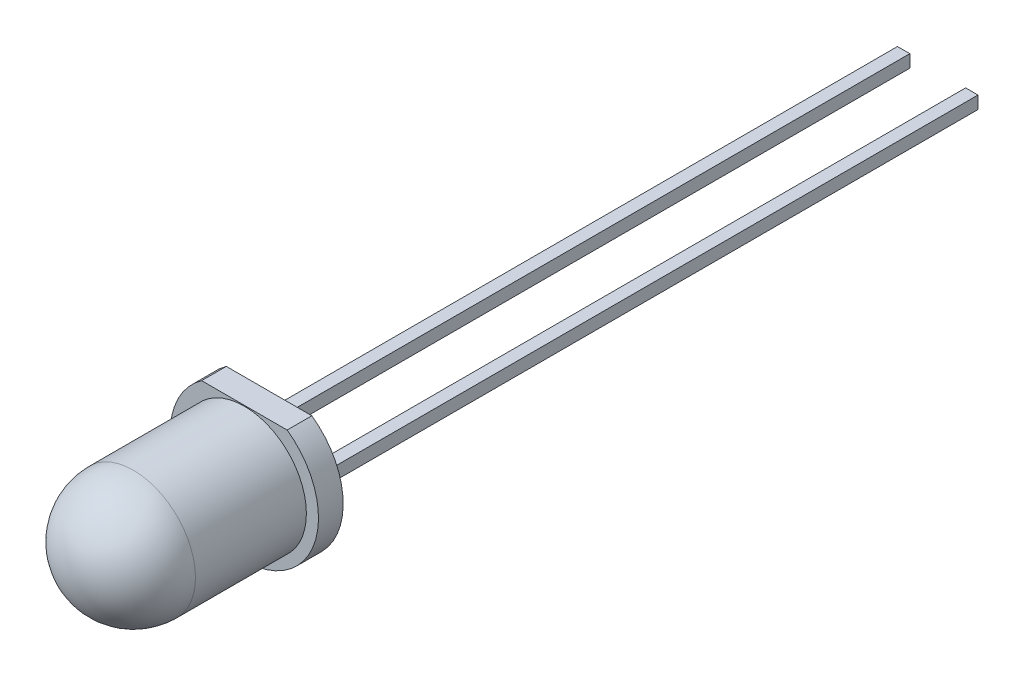
ISO-10303-21;
HEADER;
FILE_DESCRIPTION(('STEP AP214'),'2;1');
FILE_NAME('part.step','',(''),(''),'','','');
FILE_SCHEMA(('AUTOMOTIVE_DESIGN { 1 0 10303 214 1 1 1 1 }'));
ENDSEC;
DATA;
#1=APPLICATION_CONTEXT('core data for automotive mechanical design processes');
#2=APPLICATION_PROTOCOL_DEFINITION('international standard','automotive_design',2000,#1);
#3=PRODUCT_CONTEXT('',#1,'mechanical');
#4=PRODUCT('Part','Part','',(#3));
#5=PRODUCT_RELATED_PRODUCT_CATEGORY('part','',(#4));
#6=PRODUCT_DEFINITION_FORMATION('','',#4);
#7=PRODUCT_DEFINITION_CONTEXT('part definition',#1,'design');
#8=PRODUCT_DEFINITION('design','',#6,#7);
#9=PRODUCT_DEFINITION_SHAPE('','',#8);
#10=(LENGTH_UNIT() NAMED_UNIT(*) SI_UNIT(.MILLI.,.METRE.));
#11=(NAMED_UNIT(*) PLANE_ANGLE_UNIT() SI_UNIT($,.RADIAN.));
#12=(NAMED_UNIT(*) SI_UNIT($,.STERADIAN.) SOLID_ANGLE_UNIT());
#13=UNCERTAINTY_MEASURE_WITH_UNIT(LENGTH_MEASURE(1.E-05),#10,'distance_accuracy_value','');
#14=(GEOMETRIC_REPRESENTATION_CONTEXT(3) GLOBAL_UNCERTAINTY_ASSIGNED_CONTEXT((#13)) GLOBAL_UNIT_ASSIGNED_CONTEXT((#10,
#11,#12)) REPRESENTATION_CONTEXT('',''));
#15=CARTESIAN_POINT('',(0.,0.,0.));
#16=DIRECTION('',(0.,0.,1.));
#17=DIRECTION('',(1.,0.,0.));
#18=AXIS2_PLACEMENT_3D('',#15,#16,#17);
#19=CARTESIAN_POINT('',(0.,0.,0.));
#20=DIRECTION('',(0.,0.,1.));
#21=DIRECTION('',(1.,0.,0.));
#22=AXIS2_PLACEMENT_3D('',#19,#20,#21);
#23=PLANE('',#22);
#24=DIRECTION('',(0.,1.,0.));
#25=VECTOR('',#24,1.);
#26=CARTESIAN_POINT('',(-0.25,1.05,0.));
#27=LINE('',#26,#25);
#28=CARTESIAN_POINT('',(-0.25,1.05,0.));
#29=VERTEX_POINT('',#28);
#30=CARTESIAN_POINT('',(-0.25,1.56,0.));
#31=VERTEX_POINT('',#30);
#32=EDGE_CURVE('E152',#29,#31,#27,.T.);
#33=ORIENTED_EDGE('',*,*,#32,.F.);
#34=DIRECTION('',(-1.,0.,0.));
#35=VECTOR('',#34,1.);
#36=CARTESIAN_POINT('',(0.25,1.05,0.));
#37=LINE('',#36,#35);
#38=CARTESIAN_POINT('',(0.25,1.05,0.));
#39=VERTEX_POINT('',#38);
#40=EDGE_CURVE('E227',#39,#29,#37,.T.);
#41=ORIENTED_EDGE('',*,*,#40,.F.);
#42=DIRECTION('',(0.,-1.,0.));
#43=VECTOR('',#42,1.);
#44=CARTESIAN_POINT('',(0.25,1.05,0.));
#45=LINE('',#44,#43);
#46=CARTESIAN_POINT('',(0.25,1.56,0.));
#47=VERTEX_POINT('',#46);
#48=EDGE_CURVE('E317',#47,#39,#45,.T.);
#49=ORIENTED_EDGE('',*,*,#48,.F.);
#50=DIRECTION('',(1.,0.,0.));
#51=VECTOR('',#50,1.);
#52=CARTESIAN_POINT('',(0.25,1.56,0.));
#53=LINE('',#52,#51);
#54=EDGE_CURVE('E313',#31,#47,#53,.T.);
#55=ORIENTED_EDGE('',*,*,#54,.F.);
#56=EDGE_LOOP('',(#33,#41,#49,#55));
#57=FACE_BOUND('',#56,.T.);
#58=CARTESIAN_POINT('',(0.,0.,0.));
#59=DIRECTION('',(0.,0.,1.));
#60=DIRECTION('',(1.,0.,0.));
#61=AXIS2_PLACEMENT_3D('',#58,#59,#60);
#62=CIRCLE('',#61,3.);
#63=CARTESIAN_POINT('',(-1.73132896931808,2.45,0.));
#64=VERTEX_POINT('',#63);
#65=CARTESIAN_POINT('',(1.73132896931808,2.45,0.));
#66=VERTEX_POINT('',#65);
#67=EDGE_CURVE('E259',#64,#66,#62,.T.);
#68=ORIENTED_EDGE('',*,*,#67,.F.);
#69=DIRECTION('',(-1.,0.,0.));
#70=VECTOR('',#69,1.);
#71=CARTESIAN_POINT('',(-1.73132896931808,2.45,0.));
#72=LINE('',#71,#70);
#73=EDGE_CURVE('E266',#66,#64,#72,.T.);
#74=ORIENTED_EDGE('',*,*,#73,.F.);
#75=EDGE_LOOP('',(#68,#74));
#76=FACE_BOUND('',#75,.T.);
#77=DIRECTION('',(0.,1.,0.));
#78=VECTOR('',#77,1.);
#79=CARTESIAN_POINT('',(-0.25,-1.78,0.));
#80=LINE('',#79,#78);
#81=CARTESIAN_POINT('',(-0.25,-1.78,0.));
#82=VERTEX_POINT('',#81);
#83=CARTESIAN_POINT('',(-0.25,-1.27,0.));
#84=VERTEX_POINT('',#83);
#85=EDGE_CURVE('E149',#82,#84,#80,.T.);
#86=ORIENTED_EDGE('',*,*,#85,.F.);
#87=DIRECTION('',(-1.,0.,0.));
#88=VECTOR('',#87,1.);
#89=CARTESIAN_POINT('',(0.25,-1.78,0.));
#90=LINE('',#89,#88);
#91=CARTESIAN_POINT('',(0.25,-1.78,0.));
#92=VERTEX_POINT('',#91);
#93=EDGE_CURVE('E204',#92,#82,#90,.T.);
#94=ORIENTED_EDGE('',*,*,#93,.F.);
#95=DIRECTION('',(0.,-1.,0.));
#96=VECTOR('',#95,1.);
#97=CARTESIAN_POINT('',(0.25,-1.78,0.));
#98=LINE('',#97,#96);
#99=CARTESIAN_POINT('',(0.25,-1.27,0.));
#100=VERTEX_POINT('',#99);
#101=EDGE_CURVE('E73',#100,#92,#98,.T.);
#102=ORIENTED_EDGE('',*,*,#101,.F.);
#103=DIRECTION('',(1.,0.,0.));
#104=VECTOR('',#103,1.);
#105=CARTESIAN_POINT('',(0.25,-1.27,0.));
#106=LINE('',#105,#104);
#107=EDGE_CURVE('E66',#84,#100,#106,.T.);
#108=ORIENTED_EDGE('',*,*,#107,.F.);
#109=EDGE_LOOP('',(#86,#94,#102,#108));
#110=FACE_BOUND('',#109,.T.);
#111=ADVANCED_FACE('F45',(#57,#76,#110),#23,.F.);
#112=CARTESIAN_POINT('',(0.,0.,1.));
#113=DIRECTION('',(0.,0.,-1.));
#114=DIRECTION('',(-1.,0.,0.));
#115=AXIS2_PLACEMENT_3D('',#112,#113,#114);
#116=CYLINDRICAL_SURFACE('',#115,3.);
#117=ORIENTED_EDGE('',*,*,#67,.T.);
#118=DIRECTION('',(0.,0.,-1.));
#119=VECTOR('',#118,1.);
#120=CARTESIAN_POINT('',(1.73132896931808,2.45,1.));
#121=LINE('',#120,#119);
#122=CARTESIAN_POINT('',(1.73132896931808,2.45,1.));
#123=VERTEX_POINT('',#122);
#124=EDGE_CURVE('E278',#123,#66,#121,.T.);
#125=ORIENTED_EDGE('',*,*,#124,.F.);
#126=CARTESIAN_POINT('',(0.,0.,1.));
#127=DIRECTION('',(0.,0.,1.));
#128=DIRECTION('',(1.,0.,0.));
#129=AXIS2_PLACEMENT_3D('',#126,#127,#128);
#130=CIRCLE('',#129,3.);
#131=CARTESIAN_POINT('',(-1.73132896931808,2.45,1.));
#132=VERTEX_POINT('',#131);
#133=EDGE_CURVE('E260',#132,#123,#130,.T.);
#134=ORIENTED_EDGE('',*,*,#133,.F.);
#135=DIRECTION('',(0.,0.,-1.));
#136=VECTOR('',#135,1.);
#137=CARTESIAN_POINT('',(-1.73132896931808,2.45,1.));
#138=LINE('',#137,#136);
#139=EDGE_CURVE('E274',#132,#64,#138,.T.);
#140=ORIENTED_EDGE('',*,*,#139,.T.);
#141=EDGE_LOOP('',(#117,#125,#134,#140));
#142=FACE_BOUND('',#141,.T.);
#143=ADVANCED_FACE('F302',(#142),#116,.T.);
#144=CARTESIAN_POINT('',(-1.73132896931808,2.45,1.));
#145=DIRECTION('',(0.,-1.,0.));
#146=DIRECTION('',(0.,0.,-1.));
#147=AXIS2_PLACEMENT_3D('',#144,#145,#146);
#148=PLANE('',#147);
#149=ORIENTED_EDGE('',*,*,#73,.T.);
#150=ORIENTED_EDGE('',*,*,#139,.F.);
#151=DIRECTION('',(-1.,0.,0.));
#152=VECTOR('',#151,1.);
#153=CARTESIAN_POINT('',(-1.73132896931808,2.45,1.));
#154=LINE('',#153,#152);
#155=EDGE_CURVE('E265',#123,#132,#154,.T.);
#156=ORIENTED_EDGE('',*,*,#155,.F.);
#157=ORIENTED_EDGE('',*,*,#124,.T.);
#158=EDGE_LOOP('',(#149,#150,#156,#157));
#159=FACE_BOUND('',#158,.T.);
#160=ADVANCED_FACE('F297',(#159),#148,.F.);
#161=CARTESIAN_POINT('',(0.,0.,1.));
#162=DIRECTION('',(0.,0.,1.));
#163=DIRECTION('',(1.,0.,0.));
#164=AXIS2_PLACEMENT_3D('',#161,#162,#163);
#165=PLANE('',#164);
#166=CARTESIAN_POINT('',(0.,-0.0900000000000002,1.));
#167=DIRECTION('',(0.,0.,1.));
#168=DIRECTION('',(1.,0.,0.));
#169=AXIS2_PLACEMENT_3D('',#166,#167,#168);
#170=CIRCLE('',#169,2.51);
#171=CARTESIAN_POINT('',(2.51,-0.0900000000000002,1.));
#172=VERTEX_POINT('',#171);
#173=EDGE_CURVE('E56',#172,#172,#170,.T.);
#174=ORIENTED_EDGE('',*,*,#173,.F.);
#175=EDGE_LOOP('',(#174));
#176=FACE_BOUND('',#175,.T.);
#177=ORIENTED_EDGE('',*,*,#133,.T.);
#178=ORIENTED_EDGE('',*,*,#155,.T.);
#179=EDGE_LOOP('',(#177,#178));
#180=FACE_BOUND('',#179,.T.);
#181=ADVANCED_FACE('F293',(#176,#180),#165,.T.);
#182=CARTESIAN_POINT('',(-0.25,1.05,-25.69));
#183=DIRECTION('',(1.,0.,0.));
#184=DIRECTION('',(0.,0.,-1.));
#185=AXIS2_PLACEMENT_3D('',#182,#183,#184);
#186=PLANE('',#185);
#187=ORIENTED_EDGE('',*,*,#32,.T.);
#188=DIRECTION('',(0.,0.,1.));
#189=VECTOR('',#188,1.);
#190=CARTESIAN_POINT('',(-0.25,1.56,-25.69));
#191=LINE('',#190,#189);
#192=CARTESIAN_POINT('',(-0.25,1.56,-25.69));
#193=VERTEX_POINT('',#192);
#194=EDGE_CURVE('E254',#193,#31,#191,.T.);
#195=ORIENTED_EDGE('',*,*,#194,.F.);
#196=DIRECTION('',(0.,1.,0.));
#197=VECTOR('',#196,1.);
#198=CARTESIAN_POINT('',(-0.25,1.05,-25.69));
#199=LINE('',#198,#197);
#200=CARTESIAN_POINT('',(-0.25,1.05,-25.69));
#201=VERTEX_POINT('',#200);
#202=EDGE_CURVE('E221',#201,#193,#199,.T.);
#203=ORIENTED_EDGE('',*,*,#202,.F.);
#204=DIRECTION('',(0.,0.,1.));
#205=VECTOR('',#204,1.);
#206=CARTESIAN_POINT('',(-0.25,1.05,-25.69));
#207=LINE('',#206,#205);
#208=EDGE_CURVE('E238',#201,#29,#207,.T.);
#209=ORIENTED_EDGE('',*,*,#208,.T.);
#210=EDGE_LOOP('',(#187,#195,#203,#209));
#211=FACE_BOUND('',#210,.T.);
#212=ADVANCED_FACE('F296',(#211),#186,.F.);
#213=CARTESIAN_POINT('',(0.25,1.56,-25.69));
#214=DIRECTION('',(0.,-1.,0.));
#215=DIRECTION('',(0.,0.,-1.));
#216=AXIS2_PLACEMENT_3D('',#213,#214,#215);
#217=PLANE('',#216);
#218=ORIENTED_EDGE('',*,*,#54,.T.);
#219=DIRECTION('',(0.,0.,1.));
#220=VECTOR('',#219,1.);
#221=CARTESIAN_POINT('',(0.25,1.56,-25.69));
#222=LINE('',#221,#220);
#223=CARTESIAN_POINT('',(0.25,1.56,-25.69));
#224=VERTEX_POINT('',#223);
#225=EDGE_CURVE('E250',#224,#47,#222,.T.);
#226=ORIENTED_EDGE('',*,*,#225,.F.);
#227=DIRECTION('',(1.,0.,0.));
#228=VECTOR('',#227,1.);
#229=CARTESIAN_POINT('',(0.25,1.56,-25.69));
#230=LINE('',#229,#228);
#231=EDGE_CURVE('E226',#193,#224,#230,.T.);
#232=ORIENTED_EDGE('',*,*,#231,.F.);
#233=ORIENTED_EDGE('',*,*,#194,.T.);
#234=EDGE_LOOP('',(#218,#226,#232,#233));
#235=FACE_BOUND('',#234,.T.);
#236=ADVANCED_FACE('F371',(#235),#217,.F.);
#237=CARTESIAN_POINT('',(0.25,1.05,-25.69));
#238=DIRECTION('',(-1.,0.,0.));
#239=DIRECTION('',(0.,0.,1.));
#240=AXIS2_PLACEMENT_3D('',#237,#238,#239);
#241=PLANE('',#240);
#242=ORIENTED_EDGE('',*,*,#48,.T.);
#243=DIRECTION('',(0.,0.,1.));
#244=VECTOR('',#243,1.);
#245=CARTESIAN_POINT('',(0.25,1.05,-25.69));
#246=LINE('',#245,#244);
#247=CARTESIAN_POINT('',(0.25,1.05,-25.69));
#248=VERTEX_POINT('',#247);
#249=EDGE_CURVE('E243',#248,#39,#246,.T.);
#250=ORIENTED_EDGE('',*,*,#249,.F.);
#251=DIRECTION('',(0.,-1.,0.));
#252=VECTOR('',#251,1.);
#253=CARTESIAN_POINT('',(0.25,1.05,-25.69));
#254=LINE('',#253,#252);
#255=EDGE_CURVE('E340',#224,#248,#254,.T.);
#256=ORIENTED_EDGE('',*,*,#255,.F.);
#257=ORIENTED_EDGE('',*,*,#225,.T.);
#258=EDGE_LOOP('',(#242,#250,#256,#257));
#259=FACE_BOUND('',#258,.T.);
#260=ADVANCED_FACE('F374',(#259),#241,.F.);
#261=CARTESIAN_POINT('',(0.25,1.05,-25.69));
#262=DIRECTION('',(0.,1.,0.));
#263=DIRECTION('',(0.,0.,1.));
#264=AXIS2_PLACEMENT_3D('',#261,#262,#263);
#265=PLANE('',#264);
#266=ORIENTED_EDGE('',*,*,#40,.T.);
#267=ORIENTED_EDGE('',*,*,#208,.F.);
#268=DIRECTION('',(-1.,0.,0.));
#269=VECTOR('',#268,1.);
#270=CARTESIAN_POINT('',(0.25,1.05,-25.69));
#271=LINE('',#270,#269);
#272=EDGE_CURVE('E244',#248,#201,#271,.T.);
#273=ORIENTED_EDGE('',*,*,#272,.F.);
#274=ORIENTED_EDGE('',*,*,#249,.T.);
#275=EDGE_LOOP('',(#266,#267,#273,#274));
#276=FACE_BOUND('',#275,.T.);
#277=ADVANCED_FACE('F329',(#276),#265,.F.);
#278=CARTESIAN_POINT('',(0.,0.,-25.69));
#279=DIRECTION('',(0.,0.,1.));
#280=DIRECTION('',(1.,0.,0.));
#281=AXIS2_PLACEMENT_3D('',#278,#279,#280);
#282=PLANE('',#281);
#283=ORIENTED_EDGE('',*,*,#202,.T.);
#284=ORIENTED_EDGE('',*,*,#231,.T.);
#285=ORIENTED_EDGE('',*,*,#255,.T.);
#286=ORIENTED_EDGE('',*,*,#272,.T.);
#287=EDGE_LOOP('',(#283,#284,#285,#286));
#288=FACE_BOUND('',#287,.T.);
#289=ADVANCED_FACE('F337',(#288),#282,.F.);
#290=CARTESIAN_POINT('',(-0.25,-1.78,-25.69));
#291=DIRECTION('',(1.,0.,0.));
#292=DIRECTION('',(0.,0.,-1.));
#293=AXIS2_PLACEMENT_3D('',#290,#291,#292);
#294=PLANE('',#293);
#295=ORIENTED_EDGE('',*,*,#85,.T.);
#296=DIRECTION('',(0.,0.,1.));
#297=VECTOR('',#296,1.);
#298=CARTESIAN_POINT('',(-0.25,-1.27,-25.69));
#299=LINE('',#298,#297);
#300=CARTESIAN_POINT('',(-0.25,-1.27,-28.45));
#301=VERTEX_POINT('',#300);
#302=EDGE_CURVE('E143',#301,#84,#299,.T.);
#303=ORIENTED_EDGE('',*,*,#302,.F.);
#304=DIRECTION('',(0.,1.,0.));
#305=VECTOR('',#304,1.);
#306=CARTESIAN_POINT('',(-0.25,-1.27,-28.45));
#307=LINE('',#306,#305);
#308=CARTESIAN_POINT('',(-0.25,-1.78,-28.45));
#309=VERTEX_POINT('',#308);
#310=EDGE_CURVE('E148',#309,#301,#307,.T.);
#311=ORIENTED_EDGE('',*,*,#310,.F.);
#312=DIRECTION('',(0.,0.,1.));
#313=VECTOR('',#312,1.);
#314=CARTESIAN_POINT('',(-0.25,-1.78,-25.69));
#315=LINE('',#314,#313);
#316=EDGE_CURVE('E209',#309,#82,#315,.T.);
#317=ORIENTED_EDGE('',*,*,#316,.T.);
#318=EDGE_LOOP('',(#295,#303,#311,#317));
#319=FACE_BOUND('',#318,.T.);
#320=ADVANCED_FACE('F145',(#319),#294,.F.);
#321=CARTESIAN_POINT('',(0.25,-1.27,-25.69));
#322=DIRECTION('',(0.,-1.,0.));
#323=DIRECTION('',(0.,0.,-1.));
#324=AXIS2_PLACEMENT_3D('',#321,#322,#323);
#325=PLANE('',#324);
#326=ORIENTED_EDGE('',*,*,#107,.T.);
#327=DIRECTION('',(0.,0.,1.));
#328=VECTOR('',#327,1.);
#329=CARTESIAN_POINT('',(0.25,-1.27,-25.69));
#330=LINE('',#329,#328);
#331=CARTESIAN_POINT('',(0.25,-1.27,-28.45));
#332=VERTEX_POINT('',#331);
#333=EDGE_CURVE('E153',#332,#100,#330,.T.);
#334=ORIENTED_EDGE('',*,*,#333,.F.);
#335=DIRECTION('',(1.,0.,0.));
#336=VECTOR('',#335,1.);
#337=CARTESIAN_POINT('',(-0.25,-1.27,-28.45));
#338=LINE('',#337,#336);
#339=EDGE_CURVE('E156',#301,#332,#338,.T.);
#340=ORIENTED_EDGE('',*,*,#339,.F.);
#341=ORIENTED_EDGE('',*,*,#302,.T.);
#342=EDGE_LOOP('',(#326,#334,#340,#341));
#343=FACE_BOUND('',#342,.T.);
#344=ADVANCED_FACE('F157',(#343),#325,.F.);
#345=CARTESIAN_POINT('',(0.25,-1.78,-25.69));
#346=DIRECTION('',(-1.,0.,0.));
#347=DIRECTION('',(0.,0.,1.));
#348=AXIS2_PLACEMENT_3D('',#345,#346,#347);
#349=PLANE('',#348);
#350=ORIENTED_EDGE('',*,*,#101,.T.);
#351=DIRECTION('',(0.,0.,1.));
#352=VECTOR('',#351,1.);
#353=CARTESIAN_POINT('',(0.25,-1.78,-25.69));
#354=LINE('',#353,#352);
#355=CARTESIAN_POINT('',(0.25,-1.78,-28.45));
#356=VERTEX_POINT('',#355);
#357=EDGE_CURVE('E213',#356,#92,#354,.T.);
#358=ORIENTED_EDGE('',*,*,#357,.F.);
#359=DIRECTION('',(0.,-1.,0.));
#360=VECTOR('',#359,1.);
#361=CARTESIAN_POINT('',(0.25,-1.27,-28.45));
#362=LINE('',#361,#360);
#363=EDGE_CURVE('E163',#332,#356,#362,.T.);
#364=ORIENTED_EDGE('',*,*,#363,.F.);
#365=ORIENTED_EDGE('',*,*,#333,.T.);
#366=EDGE_LOOP('',(#350,#358,#364,#365));
#367=FACE_BOUND('',#366,.T.);
#368=ADVANCED_FACE('F349',(#367),#349,.F.);
#369=CARTESIAN_POINT('',(0.25,-1.78,-25.69));
#370=DIRECTION('',(0.,1.,0.));
#371=DIRECTION('',(0.,0.,1.));
#372=AXIS2_PLACEMENT_3D('',#369,#370,#371);
#373=PLANE('',#372);
#374=ORIENTED_EDGE('',*,*,#93,.T.);
#375=ORIENTED_EDGE('',*,*,#316,.F.);
#376=DIRECTION('',(-1.,0.,0.));
#377=VECTOR('',#376,1.);
#378=CARTESIAN_POINT('',(-0.25,-1.78,-28.45));
#379=LINE('',#378,#377);
#380=EDGE_CURVE('E168',#356,#309,#379,.T.);
#381=ORIENTED_EDGE('',*,*,#380,.F.);
#382=ORIENTED_EDGE('',*,*,#357,.T.);
#383=EDGE_LOOP('',(#374,#375,#381,#382));
#384=FACE_BOUND('',#383,.T.);
#385=ADVANCED_FACE('F351',(#384),#373,.F.);
#386=CARTESIAN_POINT('',(0.,0.,-28.45));
#387=DIRECTION('',(0.,0.,1.));
#388=DIRECTION('',(1.,0.,0.));
#389=AXIS2_PLACEMENT_3D('',#386,#387,#388);
#390=PLANE('',#389);
#391=ORIENTED_EDGE('',*,*,#310,.T.);
#392=ORIENTED_EDGE('',*,*,#339,.T.);
#393=ORIENTED_EDGE('',*,*,#363,.T.);
#394=ORIENTED_EDGE('',*,*,#380,.T.);
#395=EDGE_LOOP('',(#391,#392,#393,#394));
#396=FACE_BOUND('',#395,.T.);
#397=ADVANCED_FACE('F166',(#396),#390,.F.);
#398=CARTESIAN_POINT('',(0.,-0.0900000000000002,8.));
#399=DIRECTION('',(0.,0.,-1.));
#400=DIRECTION('',(-1.,0.,0.));
#401=AXIS2_PLACEMENT_3D('',#398,#399,#400);
#402=CYLINDRICAL_SURFACE('',#401,2.51);
#403=CARTESIAN_POINT('',(0.,-0.0900000000000002,5.49));
#404=DIRECTION('',(0.,0.,-1.));
#405=DIRECTION('',(-1.,0.,0.));
#406=AXIS2_PLACEMENT_3D('',#403,#404,#405);
#407=CIRCLE('',#406,2.51);
#408=CARTESIAN_POINT('',(-2.51,-0.0900000000000002,5.49));
#409=VERTEX_POINT('',#408);
#410=EDGE_CURVE('E12',#409,#409,#407,.T.);
#411=ORIENTED_EDGE('',*,*,#410,.T.);
#412=EDGE_LOOP('',(#411));
#413=FACE_BOUND('',#412,.T.);
#414=ORIENTED_EDGE('',*,*,#173,.T.);
#415=EDGE_LOOP('',(#414));
#416=FACE_BOUND('',#415,.T.);
#417=ADVANCED_FACE('F291',(#413,#416),#402,.T.);
#418=CARTESIAN_POINT('',(0.,-0.0900000000000002,5.49));
#419=DIRECTION('',(0.,0.,1.));
#420=DIRECTION('',(1.,0.,0.));
#421=AXIS2_PLACEMENT_3D('',#418,#419,#420);
#422=SPHERICAL_SURFACE('',#421,2.51);
#423=ORIENTED_EDGE('',*,*,#410,.F.);
#424=EDGE_LOOP('',(#423));
#425=FACE_BOUND('',#424,.T.);
#426=ADVANCED_FACE('F48',(#425),#422,.T.);
#427=CLOSED_SHELL('',(#111,#143,#160,#181,#212,#236,#260,#277,#289,#320,#344,#368,#385,#397,
#417,#426));
#428=MANIFOLD_SOLID_BREP('B2',#427);
#429=ADVANCED_BREP_SHAPE_REPRESENTATION('',(#18,#428),#14);
#430=SHAPE_DEFINITION_REPRESENTATION(#9,#429);
ENDSEC;
END-ISO-10303-21;
